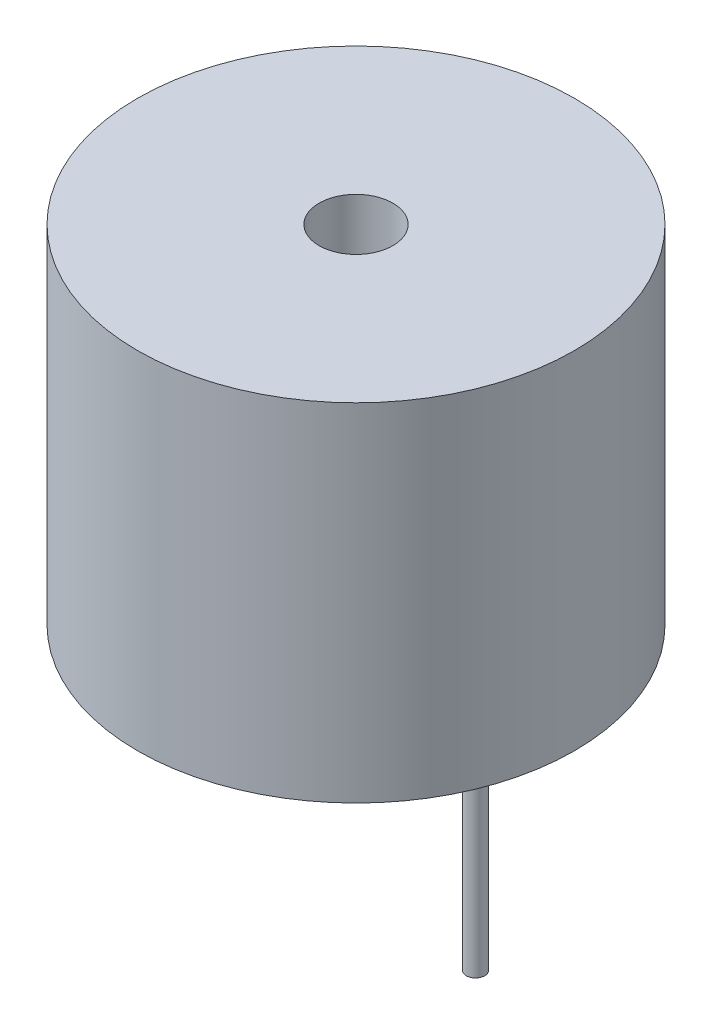
ISO-10303-21;
HEADER;
FILE_DESCRIPTION(('STEP AP214'),'2;1');
FILE_NAME('part.step','',(''),(''),'','','');
FILE_SCHEMA(('AUTOMOTIVE_DESIGN { 1 0 10303 214 1 1 1 1 }'));
ENDSEC;
DATA;
#1=APPLICATION_CONTEXT('core data for automotive mechanical design processes');
#2=APPLICATION_PROTOCOL_DEFINITION('international standard','automotive_design',2000,#1);
#3=PRODUCT_CONTEXT('',#1,'mechanical');
#4=PRODUCT('Part','Part','',(#3));
#5=PRODUCT_RELATED_PRODUCT_CATEGORY('part','',(#4));
#6=PRODUCT_DEFINITION_FORMATION('','',#4);
#7=PRODUCT_DEFINITION_CONTEXT('part definition',#1,'design');
#8=PRODUCT_DEFINITION('design','',#6,#7);
#9=PRODUCT_DEFINITION_SHAPE('','',#8);
#10=(LENGTH_UNIT() NAMED_UNIT(*) SI_UNIT(.MILLI.,.METRE.));
#11=(NAMED_UNIT(*) PLANE_ANGLE_UNIT() SI_UNIT($,.RADIAN.));
#12=(NAMED_UNIT(*) SI_UNIT($,.STERADIAN.) SOLID_ANGLE_UNIT());
#13=UNCERTAINTY_MEASURE_WITH_UNIT(LENGTH_MEASURE(1.E-05),#10,'distance_accuracy_value','');
#14=(GEOMETRIC_REPRESENTATION_CONTEXT(3) GLOBAL_UNCERTAINTY_ASSIGNED_CONTEXT((#13)) GLOBAL_UNIT_ASSIGNED_CONTEXT((#10,
#11,#12)) REPRESENTATION_CONTEXT('',''));
#15=CARTESIAN_POINT('',(0.,0.,0.));
#16=DIRECTION('',(0.,0.,1.));
#17=DIRECTION('',(1.,0.,0.));
#18=AXIS2_PLACEMENT_3D('',#15,#16,#17);
#19=CARTESIAN_POINT('',(0.,9.4,0.));
#20=DIRECTION('',(0.,-1.,0.));
#21=DIRECTION('',(0.,0.,-1.));
#22=AXIS2_PLACEMENT_3D('',#19,#20,#21);
#23=CYLINDRICAL_SURFACE('',#22,5.925);
#24=CARTESIAN_POINT('',(0.,9.4,0.));
#25=DIRECTION('',(0.,1.,0.));
#26=DIRECTION('',(0.,0.,1.));
#27=AXIS2_PLACEMENT_3D('',#24,#25,#26);
#28=CIRCLE('',#27,5.925);
#29=CARTESIAN_POINT('',(0.,9.4,5.925));
#30=VERTEX_POINT('',#29);
#31=EDGE_CURVE('E42',#30,#30,#28,.T.);
#32=ORIENTED_EDGE('',*,*,#31,.F.);
#33=EDGE_LOOP('',(#32));
#34=FACE_BOUND('',#33,.T.);
#35=CARTESIAN_POINT('',(0.,0.,0.));
#36=DIRECTION('',(0.,1.,0.));
#37=DIRECTION('',(0.,0.,1.));
#38=AXIS2_PLACEMENT_3D('',#35,#36,#37);
#39=CIRCLE('',#38,5.925);
#40=CARTESIAN_POINT('',(0.,0.,5.925));
#41=VERTEX_POINT('',#40);
#42=EDGE_CURVE('E46',#41,#41,#39,.T.);
#43=ORIENTED_EDGE('',*,*,#42,.T.);
#44=EDGE_LOOP('',(#43));
#45=FACE_BOUND('',#44,.T.);
#46=ADVANCED_FACE('F32',(#34,#45),#23,.T.);
#47=CARTESIAN_POINT('',(0.,9.4,0.));
#48=DIRECTION('',(0.,1.,0.));
#49=DIRECTION('',(0.,0.,1.));
#50=AXIS2_PLACEMENT_3D('',#47,#48,#49);
#51=PLANE('',#50);
#52=CARTESIAN_POINT('',(0.,9.4,0.));
#53=DIRECTION('',(0.,1.,0.));
#54=DIRECTION('',(0.,0.,1.));
#55=AXIS2_PLACEMENT_3D('',#52,#53,#54);
#56=CIRCLE('',#55,1.);
#57=CARTESIAN_POINT('',(0.,9.4,1.));
#58=VERTEX_POINT('',#57);
#59=EDGE_CURVE('E58',#58,#58,#56,.T.);
#60=ORIENTED_EDGE('',*,*,#59,.F.);
#61=EDGE_LOOP('',(#60));
#62=FACE_BOUND('',#61,.T.);
#63=ORIENTED_EDGE('',*,*,#31,.T.);
#64=EDGE_LOOP('',(#63));
#65=FACE_BOUND('',#64,.T.);
#66=ADVANCED_FACE('F73',(#62,#65),#51,.T.);
#67=CARTESIAN_POINT('',(0.,0.,0.));
#68=DIRECTION('',(0.,1.,0.));
#69=DIRECTION('',(0.,0.,1.));
#70=AXIS2_PLACEMENT_3D('',#67,#68,#69);
#71=PLANE('',#70);
#72=CARTESIAN_POINT('',(3.24178625430537,0.,0.));
#73=DIRECTION('',(0.,1.,0.));
#74=DIRECTION('',(0.,0.,1.));
#75=AXIS2_PLACEMENT_3D('',#72,#73,#74);
#76=CIRCLE('',#75,0.25);
#77=CARTESIAN_POINT('',(3.24178625430537,0.,0.25));
#78=VERTEX_POINT('',#77);
#79=EDGE_CURVE('E10',#78,#78,#76,.F.);
#80=ORIENTED_EDGE('',*,*,#79,.F.);
#81=EDGE_LOOP('',(#80));
#82=FACE_BOUND('',#81,.T.);
#83=CARTESIAN_POINT('',(-3.24178625430537,0.,0.));
#84=DIRECTION('',(0.,1.,0.));
#85=DIRECTION('',(0.,0.,1.));
#86=AXIS2_PLACEMENT_3D('',#83,#84,#85);
#87=CIRCLE('',#86,0.25);
#88=CARTESIAN_POINT('',(-3.24178625430537,0.,0.25));
#89=VERTEX_POINT('',#88);
#90=EDGE_CURVE('E38',#89,#89,#87,.F.);
#91=ORIENTED_EDGE('',*,*,#90,.F.);
#92=EDGE_LOOP('',(#91));
#93=FACE_BOUND('',#92,.T.);
#94=ORIENTED_EDGE('',*,*,#42,.F.);
#95=EDGE_LOOP('',(#94));
#96=FACE_BOUND('',#95,.T.);
#97=ADVANCED_FACE('F76',(#82,#93,#96),#71,.F.);
#98=CARTESIAN_POINT('',(-3.24178625430537,-4.9,0.));
#99=DIRECTION('',(0.,1.,0.));
#100=DIRECTION('',(0.,0.,1.));
#101=AXIS2_PLACEMENT_3D('',#98,#99,#100);
#102=CYLINDRICAL_SURFACE('',#101,0.25);
#103=CARTESIAN_POINT('',(-3.24178625430537,-4.9,0.));
#104=DIRECTION('',(0.,-1.,0.));
#105=DIRECTION('',(0.,0.,-1.));
#106=AXIS2_PLACEMENT_3D('',#103,#104,#105);
#107=CIRCLE('',#106,0.25);
#108=CARTESIAN_POINT('',(-3.24178625430537,-4.9,-0.25));
#109=VERTEX_POINT('',#108);
#110=EDGE_CURVE('E50',#109,#109,#107,.T.);
#111=ORIENTED_EDGE('',*,*,#110,.F.);
#112=EDGE_LOOP('',(#111));
#113=FACE_BOUND('',#112,.T.);
#114=ORIENTED_EDGE('',*,*,#90,.T.);
#115=EDGE_LOOP('',(#114));
#116=FACE_BOUND('',#115,.T.);
#117=ADVANCED_FACE('F85',(#113,#116),#102,.T.);
#118=CARTESIAN_POINT('',(-3.24178625430537,-4.9,0.));
#119=DIRECTION('',(0.,-1.,0.));
#120=DIRECTION('',(0.,0.,-1.));
#121=AXIS2_PLACEMENT_3D('',#118,#119,#120);
#122=PLANE('',#121);
#123=ORIENTED_EDGE('',*,*,#110,.T.);
#124=EDGE_LOOP('',(#123));
#125=FACE_BOUND('',#124,.T.);
#126=ADVANCED_FACE('F90',(#125),#122,.T.);
#127=CARTESIAN_POINT('',(3.24178625430537,-6.5,0.));
#128=DIRECTION('',(0.,1.,0.));
#129=DIRECTION('',(0.,0.,1.));
#130=AXIS2_PLACEMENT_3D('',#127,#128,#129);
#131=CYLINDRICAL_SURFACE('',#130,0.25);
#132=CARTESIAN_POINT('',(3.24178625430537,-6.5,0.));
#133=DIRECTION('',(0.,-1.,0.));
#134=DIRECTION('',(0.,0.,1.));
#135=AXIS2_PLACEMENT_3D('',#132,#133,#134);
#136=CIRCLE('',#135,0.25);
#137=CARTESIAN_POINT('',(3.24178625430537,-6.5,0.25));
#138=VERTEX_POINT('',#137);
#139=EDGE_CURVE('E54',#138,#138,#136,.T.);
#140=ORIENTED_EDGE('',*,*,#139,.F.);
#141=EDGE_LOOP('',(#140));
#142=FACE_BOUND('',#141,.T.);
#143=ORIENTED_EDGE('',*,*,#79,.T.);
#144=EDGE_LOOP('',(#143));
#145=FACE_BOUND('',#144,.T.);
#146=ADVANCED_FACE('F97',(#142,#145),#131,.T.);
#147=CARTESIAN_POINT('',(3.24178625430537,-6.5,0.));
#148=DIRECTION('',(0.,1.,0.));
#149=DIRECTION('',(0.,0.,1.));
#150=AXIS2_PLACEMENT_3D('',#147,#148,#149);
#151=PLANE('',#150);
#152=ORIENTED_EDGE('',*,*,#139,.T.);
#153=EDGE_LOOP('',(#152));
#154=FACE_BOUND('',#153,.T.);
#155=ADVANCED_FACE('F69',(#154),#151,.F.);
#156=CARTESIAN_POINT('',(0.,4.9,0.));
#157=DIRECTION('',(0.,1.,0.));
#158=DIRECTION('',(0.,0.,1.));
#159=AXIS2_PLACEMENT_3D('',#156,#157,#158);
#160=CYLINDRICAL_SURFACE('',#159,1.);
#161=CARTESIAN_POINT('',(0.,4.9,0.));
#162=DIRECTION('',(0.,1.,0.));
#163=DIRECTION('',(0.,0.,1.));
#164=AXIS2_PLACEMENT_3D('',#161,#162,#163);
#165=CIRCLE('',#164,1.);
#166=CARTESIAN_POINT('',(0.,4.9,1.));
#167=VERTEX_POINT('',#166);
#168=EDGE_CURVE('E57',#167,#167,#165,.T.);
#169=ORIENTED_EDGE('',*,*,#168,.F.);
#170=EDGE_LOOP('',(#169));
#171=FACE_BOUND('',#170,.T.);
#172=ORIENTED_EDGE('',*,*,#59,.T.);
#173=EDGE_LOOP('',(#172));
#174=FACE_BOUND('',#173,.T.);
#175=ADVANCED_FACE('F66',(#171,#174),#160,.F.);
#176=CARTESIAN_POINT('',(0.,4.9,0.));
#177=DIRECTION('',(0.,1.,0.));
#178=DIRECTION('',(0.,0.,1.));
#179=AXIS2_PLACEMENT_3D('',#176,#177,#178);
#180=PLANE('',#179);
#181=ORIENTED_EDGE('',*,*,#168,.T.);
#182=EDGE_LOOP('',(#181));
#183=FACE_BOUND('',#182,.T.);
#184=ADVANCED_FACE('F64',(#183),#180,.T.);
#185=CLOSED_SHELL('',(#46,#66,#97,#117,#126,#146,#155,#175,#184));
#186=MANIFOLD_SOLID_BREP('B2',#185);
#187=ADVANCED_BREP_SHAPE_REPRESENTATION('',(#18,#186),#14);
#188=SHAPE_DEFINITION_REPRESENTATION(#9,#187);
ENDSEC;
END-ISO-10303-21;
